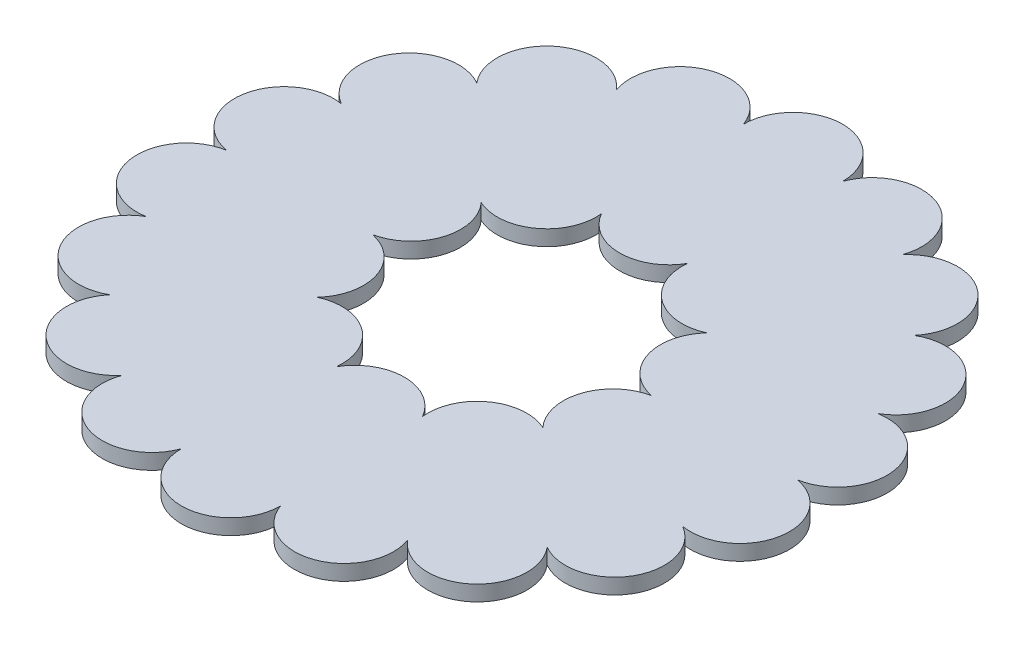
ISO-10303-21;
HEADER;
FILE_DESCRIPTION(('STEP AP214'),'2;1');
FILE_NAME('part.step','',(''),(''),'','','');
FILE_SCHEMA(('AUTOMOTIVE_DESIGN { 1 0 10303 214 1 1 1 1 }'));
ENDSEC;
DATA;
#1=APPLICATION_CONTEXT('core data for automotive mechanical design processes');
#2=APPLICATION_PROTOCOL_DEFINITION('international standard','automotive_design',2000,#1);
#3=PRODUCT_CONTEXT('',#1,'mechanical');
#4=PRODUCT('Part','Part','',(#3));
#5=PRODUCT_RELATED_PRODUCT_CATEGORY('part','',(#4));
#6=PRODUCT_DEFINITION_FORMATION('','',#4);
#7=PRODUCT_DEFINITION_CONTEXT('part definition',#1,'design');
#8=PRODUCT_DEFINITION('design','',#6,#7);
#9=PRODUCT_DEFINITION_SHAPE('','',#8);
#10=(LENGTH_UNIT() NAMED_UNIT(*) SI_UNIT(.MILLI.,.METRE.));
#11=(NAMED_UNIT(*) PLANE_ANGLE_UNIT() SI_UNIT($,.RADIAN.));
#12=(NAMED_UNIT(*) SI_UNIT($,.STERADIAN.) SOLID_ANGLE_UNIT());
#13=UNCERTAINTY_MEASURE_WITH_UNIT(LENGTH_MEASURE(1.E-05),#10,'distance_accuracy_value','');
#14=(GEOMETRIC_REPRESENTATION_CONTEXT(3) GLOBAL_UNCERTAINTY_ASSIGNED_CONTEXT((#13)) GLOBAL_UNIT_ASSIGNED_CONTEXT((#10,
#11,#12)) REPRESENTATION_CONTEXT('',''));
#15=CARTESIAN_POINT('',(0.,0.,0.));
#16=DIRECTION('',(0.,0.,1.));
#17=DIRECTION('',(1.,0.,0.));
#18=AXIS2_PLACEMENT_3D('',#15,#16,#17);
#19=CARTESIAN_POINT('',(0.,6.35,0.));
#20=DIRECTION('',(0.,1.,0.));
#21=DIRECTION('',(0.,0.,1.));
#22=AXIS2_PLACEMENT_3D('',#19,#20,#21);
#23=PLANE('',#22);
#24=CARTESIAN_POINT('',(0.,6.35,-64.4025612106915));
#25=DIRECTION('',(0.,1.,0.));
#26=DIRECTION('',(0.,0.,1.));
#27=AXIS2_PLACEMENT_3D('',#24,#25,#26);
#28=CIRCLE('',#27,20.32);
#29=CARTESIAN_POINT('',(-17.6595919495229,6.35,-54.3506354162805));
#30=VERTEX_POINT('',#29);
#31=CARTESIAN_POINT('',(17.6595919495239,6.35,-54.3506354162823));
#32=VERTEX_POINT('',#31);
#33=EDGE_CURVE('E320',#30,#32,#28,.T.);
#34=ORIENTED_EDGE('',*,*,#33,.T.);
#35=CARTESIAN_POINT('',(37.8548756895078,6.35,-52.1027665007222));
#36=DIRECTION('',(0.,1.,0.));
#37=DIRECTION('',(0.,0.,1.));
#38=AXIS2_PLACEMENT_3D('',#35,#36,#37);
#39=CIRCLE('',#38,20.32);
#40=CARTESIAN_POINT('',(46.2334119513036,6.35,-33.5905399974143));
#41=VERTEX_POINT('',#40);
#42=EDGE_CURVE('E503',#32,#41,#39,.T.);
#43=ORIENTED_EDGE('',*,*,#42,.T.);
#44=CARTESIAN_POINT('',(61.2504755055276,6.35,-19.9014858953791));
#45=DIRECTION('',(0.,1.,0.));
#46=DIRECTION('',(0.,0.,1.));
#47=AXIS2_PLACEMENT_3D('',#44,#45,#46);
#48=CIRCLE('',#47,20.3200000000012);
#49=CARTESIAN_POINT('',(57.1476400035595,6.35,-3.29597460435593E-12));
#50=VERTEX_POINT('',#49);
#51=EDGE_CURVE('E496',#41,#50,#48,.T.);
#52=ORIENTED_EDGE('',*,*,#51,.T.);
#53=CARTESIAN_POINT('',(61.2504755055293,6.35,19.9014858953739));
#54=DIRECTION('',(0.,1.,0.));
#55=DIRECTION('',(0.,0.,1.));
#56=AXIS2_PLACEMENT_3D('',#53,#54,#55);
#57=CIRCLE('',#56,20.3200000000029);
#58=CARTESIAN_POINT('',(46.2334119512969,6.35,33.5905399974024));
#59=VERTEX_POINT('',#58);
#60=EDGE_CURVE('E489',#50,#59,#57,.T.);
#61=ORIENTED_EDGE('',*,*,#60,.T.);
#62=CARTESIAN_POINT('',(37.8548756895127,6.35,52.1027665007206));
#63=DIRECTION('',(0.,1.,0.));
#64=DIRECTION('',(0.,0.,1.));
#65=AXIS2_PLACEMENT_3D('',#62,#63,#64);
#66=CIRCLE('',#65,20.3200000000046);
#67=CARTESIAN_POINT('',(17.6595919495215,6.35,54.350635416257));
#68=VERTEX_POINT('',#67);
#69=EDGE_CURVE('E482',#59,#68,#66,.T.);
#70=ORIENTED_EDGE('',*,*,#69,.T.);
#71=CARTESIAN_POINT('',(5.47551856582354E-12,6.35,64.4025612106915));
#72=DIRECTION('',(0.,1.,0.));
#73=DIRECTION('',(0.,0.,1.));
#74=AXIS2_PLACEMENT_3D('',#71,#72,#73);
#75=CIRCLE('',#74,20.3200000000057);
#76=CARTESIAN_POINT('',(-17.65959194951,6.35,54.350635416256));
#77=VERTEX_POINT('',#76);
#78=EDGE_CURVE('E475',#68,#77,#75,.T.);
#79=ORIENTED_EDGE('',*,*,#78,.T.);
#80=CARTESIAN_POINT('',(-37.8548756895028,6.35,52.1027665007239));
#81=DIRECTION('',(0.,1.,0.));
#82=DIRECTION('',(0.,0.,1.));
#83=AXIS2_PLACEMENT_3D('',#80,#81,#82);
#84=CIRCLE('',#83,20.3200000000057);
#85=CARTESIAN_POINT('',(-46.2334119512824,6.35,33.5905399974024));
#86=VERTEX_POINT('',#85);
#87=EDGE_CURVE('E469',#77,#86,#84,.T.);
#88=ORIENTED_EDGE('',*,*,#87,.T.);
#89=CARTESIAN_POINT('',(-61.2504755055221,6.35,19.9014858953791));
#90=DIRECTION('',(0.,1.,0.));
#91=DIRECTION('',(0.,0.,1.));
#92=AXIS2_PLACEMENT_3D('',#89,#90,#91);
#93=CIRCLE('',#92,20.3200000000048);
#94=CARTESIAN_POINT('',(-57.1476400035444,6.35,1.66186508998578E-12));
#95=VERTEX_POINT('',#94);
#96=EDGE_CURVE('E449',#86,#95,#93,.T.);
#97=ORIENTED_EDGE('',*,*,#96,.T.);
#98=CARTESIAN_POINT('',(-61.2504755055238,6.35,-19.9014858953739));
#99=DIRECTION('',(0.,1.,0.));
#100=DIRECTION('',(0.,0.,1.));
#101=AXIS2_PLACEMENT_3D('',#98,#99,#100);
#102=CIRCLE('',#101,20.3200000000033);
#103=CARTESIAN_POINT('',(-46.233411951302,6.35,-33.5905399974145));
#104=VERTEX_POINT('',#103);
#105=EDGE_CURVE('E441',#95,#104,#102,.T.);
#106=ORIENTED_EDGE('',*,*,#105,.T.);
#107=CARTESIAN_POINT('',(-37.8548756895071,6.35,-52.1027665007228));
#108=DIRECTION('',(0.,1.,0.));
#109=DIRECTION('',(0.,0.,1.));
#110=AXIS2_PLACEMENT_3D('',#107,#108,#109);
#111=CIRCLE('',#110,20.32);
#112=EDGE_CURVE('E446',#104,#30,#111,.T.);
#113=ORIENTED_EDGE('',*,*,#112,.T.);
#114=EDGE_LOOP('',(#34,#43,#52,#61,#70,#79,#88,#97,#106,#113));
#115=FACE_BOUND('',#114,.T.);
#116=CARTESIAN_POINT('',(-99.7683445894874,6.35,-57.6012806053401));
#117=DIRECTION('',(0.,1.,0.));
#118=DIRECTION('',(0.,0.,1.));
#119=AXIS2_PLACEMENT_3D('',#116,#117,#118);
#120=CIRCLE('',#119,20.3200000000061);
#121=CARTESIAN_POINT('',(-89.6410001009598,6.35,-75.217730123076));
#122=VERTEX_POINT('',#121);
#123=CARTESIAN_POINT('',(-109.960965152077,6.35,-40.0225182465356));
#124=VERTEX_POINT('',#123);
#125=EDGE_CURVE('E1003',#122,#124,#120,.T.);
#126=ORIENTED_EDGE('',*,*,#125,.T.);
#127=CARTESIAN_POINT('',(-113.452375447147,6.35,-20.0047148167931));
#128=DIRECTION('',(0.,1.,0.));
#129=DIRECTION('',(0.,0.,1.));
#130=AXIS2_PLACEMENT_3D('',#127,#128,#129);
#131=CIRCLE('',#130,20.3200000000082);
#132=CARTESIAN_POINT('',(-117.01801495485,6.35,5.59274848654923E-12));
#133=VERTEX_POINT('',#132);
#134=EDGE_CURVE('E992',#124,#133,#131,.T.);
#135=ORIENTED_EDGE('',*,*,#134,.T.);
#136=CARTESIAN_POINT('',(-113.452375447145,6.35,20.004714816806));
#137=DIRECTION('',(0.,1.,0.));
#138=DIRECTION('',(0.,0.,1.));
#139=AXIS2_PLACEMENT_3D('',#136,#137,#138);
#140=CIRCLE('',#139,20.3200000000103);
#141=CARTESIAN_POINT('',(-109.960965152095,6.35,40.0225182465542));
#142=VERTEX_POINT('',#141);
#143=EDGE_CURVE('E1014',#133,#142,#140,.T.);
#144=ORIENTED_EDGE('',*,*,#143,.T.);
#145=CARTESIAN_POINT('',(-99.7683445894808,6.35,57.6012806053515));
#146=DIRECTION('',(0.,1.,0.));
#147=DIRECTION('',(0.,0.,1.));
#148=AXIS2_PLACEMENT_3D('',#145,#146,#147);
#149=CIRCLE('',#148,20.3200000000121);
#150=CARTESIAN_POINT('',(-89.6410001009853,6.35,75.2177301231127));
#151=VERTEX_POINT('',#150);
#152=EDGE_CURVE('E1019',#142,#151,#149,.T.);
#153=ORIENTED_EDGE('',*,*,#152,.T.);
#154=CARTESIAN_POINT('',(-74.0507789503761,6.35,88.2502818485284));
#155=DIRECTION('',(0.,1.,0.));
#156=DIRECTION('',(0.,0.,1.));
#157=AXIS2_PLACEMENT_3D('',#154,#155,#156);
#158=CIRCLE('',#157,20.3200000000132);
#159=CARTESIAN_POINT('',(-58.5090074774276,6.35,101.340573651356));
#160=VERTEX_POINT('',#159);
#161=EDGE_CURVE('E1024',#151,#160,#158,.T.);
#162=ORIENTED_EDGE('',*,*,#161,.T.);
#163=CARTESIAN_POINT('',(-39.4015964967522,6.35,108.254996665326));
#164=DIRECTION('',(0.,1.,0.));
#165=DIRECTION('',(0.,0.,1.));
#166=AXIS2_PLACEMENT_3D('',#163,#164,#165);
#167=CIRCLE('',#166,20.3200000000136);
#168=CARTESIAN_POINT('',(-20.3199650511032,6.35,115.240248369665));
#169=VERTEX_POINT('',#168);
#170=EDGE_CURVE('E1029',#160,#169,#167,.T.);
#171=ORIENTED_EDGE('',*,*,#170,.T.);
#172=CARTESIAN_POINT('',(1.30687983919064E-11,6.35,115.202561210692));
#173=DIRECTION('',(0.,1.,0.));
#174=DIRECTION('',(0.,0.,1.));
#175=AXIS2_PLACEMENT_3D('',#172,#173,#174);
#176=CIRCLE('',#175,20.3200000000133);
#177=CARTESIAN_POINT('',(20.3199650511294,6.35,115.240248369659));
#178=VERTEX_POINT('',#177);
#179=EDGE_CURVE('E1034',#169,#178,#176,.T.);
#180=ORIENTED_EDGE('',*,*,#179,.T.);
#181=CARTESIAN_POINT('',(39.4015964967775,6.35,108.254996665322));
#182=DIRECTION('',(0.,1.,0.));
#183=DIRECTION('',(0.,0.,1.));
#184=AXIS2_PLACEMENT_3D('',#181,#182,#183);
#185=CIRCLE('',#184,20.3200000000121);
#186=CARTESIAN_POINT('',(58.5090074774467,6.35,101.340573651339));
#187=VERTEX_POINT('',#186);
#188=EDGE_CURVE('E1039',#178,#187,#185,.T.);
#189=ORIENTED_EDGE('',*,*,#188,.T.);
#190=CARTESIAN_POINT('',(74.0507789503992,6.35,88.25028184852));
#191=DIRECTION('',(0.,1.,0.));
#192=DIRECTION('',(0.,0.,1.));
#193=AXIS2_PLACEMENT_3D('',#190,#191,#192);
#194=CIRCLE('',#193,20.3200000000104);
#195=CARTESIAN_POINT('',(89.6410001009927,6.35,75.2177301230899));
#196=VERTEX_POINT('',#195);
#197=EDGE_CURVE('E1044',#187,#196,#194,.T.);
#198=ORIENTED_EDGE('',*,*,#197,.T.);
#199=CARTESIAN_POINT('',(99.7683445895005,6.35,57.6012806053401));
#200=DIRECTION('',(0.,1.,0.));
#201=DIRECTION('',(0.,0.,1.));
#202=AXIS2_PLACEMENT_3D('',#199,#200,#201);
#203=CIRCLE('',#202,20.3200000000083);
#204=CARTESIAN_POINT('',(109.960965152091,6.35,40.0225182465334));
#205=VERTEX_POINT('',#204);
#206=EDGE_CURVE('E1049',#196,#205,#203,.T.);
#207=ORIENTED_EDGE('',*,*,#206,.T.);
#208=CARTESIAN_POINT('',(113.45237544716,6.35,20.0047148167932));
#209=DIRECTION('',(0.,1.,0.));
#210=DIRECTION('',(0.,0.,1.));
#211=AXIS2_PLACEMENT_3D('',#208,#209,#210);
#212=CIRCLE('',#211,20.3200000000059);
#213=CARTESIAN_POINT('',(117.018014954837,6.35,-7.77850006628E-12));
#214=VERTEX_POINT('',#213);
#215=EDGE_CURVE('E1054',#205,#214,#212,.T.);
#216=ORIENTED_EDGE('',*,*,#215,.T.);
#217=CARTESIAN_POINT('',(113.452375447158,6.35,-20.004714816806));
#218=DIRECTION('',(0.,1.,0.));
#219=DIRECTION('',(0.,0.,1.));
#220=AXIS2_PLACEMENT_3D('',#217,#218,#219);
#221=CIRCLE('',#220,20.3200000000036);
#222=CARTESIAN_POINT('',(109.960965152062,6.35,-40.0225182465394));
#223=VERTEX_POINT('',#222);
#224=EDGE_CURVE('E1059',#214,#223,#221,.T.);
#225=ORIENTED_EDGE('',*,*,#224,.T.);
#226=CARTESIAN_POINT('',(99.7683445894939,6.35,-57.6012806053514));
#227=DIRECTION('',(0.,1.,0.));
#228=DIRECTION('',(0.,0.,1.));
#229=AXIS2_PLACEMENT_3D('',#226,#227,#228);
#230=CIRCLE('',#229,20.3200000000017);
#231=CARTESIAN_POINT('',(89.6410001009469,6.35,-75.2177301230712));
#232=VERTEX_POINT('',#231);
#233=EDGE_CURVE('E1064',#223,#232,#230,.T.);
#234=ORIENTED_EDGE('',*,*,#233,.T.);
#235=CARTESIAN_POINT('',(74.0507789503892,6.35,-88.2502818485284));
#236=DIRECTION('',(0.,1.,0.));
#237=DIRECTION('',(0.,0.,1.));
#238=AXIS2_PLACEMENT_3D('',#235,#236,#237);
#239=CIRCLE('',#238,20.3200000000004);
#240=CARTESIAN_POINT('',(58.5090074774037,6.35,-101.340573651292));
#241=VERTEX_POINT('',#240);
#242=EDGE_CURVE('E1069',#232,#241,#239,.T.);
#243=ORIENTED_EDGE('',*,*,#242,.T.);
#244=CARTESIAN_POINT('',(39.4015964967649,6.35,-108.254996665324));
#245=DIRECTION('',(0.,1.,0.));
#246=DIRECTION('',(0.,0.,1.));
#247=AXIS2_PLACEMENT_3D('',#244,#245,#246);
#248=CIRCLE('',#247,20.32);
#249=CARTESIAN_POINT('',(20.3199650511032,6.35,-115.240248369588));
#250=VERTEX_POINT('',#249);
#251=EDGE_CURVE('E1074',#241,#250,#248,.T.);
#252=ORIENTED_EDGE('',*,*,#251,.T.);
#253=CARTESIAN_POINT('',(0.,6.35,-115.202561210692));
#254=DIRECTION('',(0.,1.,0.));
#255=DIRECTION('',(0.,0.,1.));
#256=AXIS2_PLACEMENT_3D('',#253,#254,#255);
#257=CIRCLE('',#256,20.32);
#258=CARTESIAN_POINT('',(-20.3199650511032,6.35,-115.240248369593));
#259=VERTEX_POINT('',#258);
#260=EDGE_CURVE('E1079',#250,#259,#257,.T.);
#261=ORIENTED_EDGE('',*,*,#260,.T.);
#262=CARTESIAN_POINT('',(-39.4015964967635,6.35,-108.254996665324));
#263=DIRECTION('',(0.,1.,0.));
#264=DIRECTION('',(0.,0.,1.));
#265=AXIS2_PLACEMENT_3D('',#262,#263,#264);
#266=CIRCLE('',#265,20.32);
#267=CARTESIAN_POINT('',(-58.5090074774013,6.35,-101.34057365129));
#268=VERTEX_POINT('',#267);
#269=EDGE_CURVE('E330',#259,#268,#266,.T.);
#270=ORIENTED_EDGE('',*,*,#269,.T.);
#271=CARTESIAN_POINT('',(-74.0507789503861,6.35,-88.2502818485199));
#272=DIRECTION('',(0.,1.,0.));
#273=DIRECTION('',(0.,0.,1.));
#274=AXIS2_PLACEMENT_3D('',#271,#272,#273);
#275=CIRCLE('',#274,20.3200000000041);
#276=EDGE_CURVE('E508',#268,#122,#275,.T.);
#277=ORIENTED_EDGE('',*,*,#276,.T.);
#278=EDGE_LOOP('',(#126,#135,#144,#153,#162,#171,#180,#189,#198,#207,#216,#225,#234,#243,#252,
#261,#270,#277));
#279=FACE_BOUND('',#278,.T.);
#280=ADVANCED_FACE('F249',(#115,#279),#23,.T.);
#281=CARTESIAN_POINT('',(0.,0.,0.));
#282=DIRECTION('',(0.,1.,0.));
#283=DIRECTION('',(0.,0.,1.));
#284=AXIS2_PLACEMENT_3D('',#281,#282,#283);
#285=PLANE('',#284);
#286=CARTESIAN_POINT('',(37.8548756895078,0.,-52.1027665007222));
#287=DIRECTION('',(0.,1.,0.));
#288=DIRECTION('',(0.,0.,1.));
#289=AXIS2_PLACEMENT_3D('',#286,#287,#288);
#290=CIRCLE('',#289,20.32);
#291=CARTESIAN_POINT('',(17.6595919495239,0.,-54.3506354162823));
#292=VERTEX_POINT('',#291);
#293=CARTESIAN_POINT('',(46.2334119513036,0.,-33.5905399974143));
#294=VERTEX_POINT('',#293);
#295=EDGE_CURVE('E500',#292,#294,#290,.T.);
#296=ORIENTED_EDGE('',*,*,#295,.F.);
#297=CARTESIAN_POINT('',(0.,0.,-64.4025612106915));
#298=DIRECTION('',(0.,1.,0.));
#299=DIRECTION('',(0.,0.,1.));
#300=AXIS2_PLACEMENT_3D('',#297,#298,#299);
#301=CIRCLE('',#300,20.32);
#302=CARTESIAN_POINT('',(-17.6595919495229,0.,-54.3506354162805));
#303=VERTEX_POINT('',#302);
#304=EDGE_CURVE('E505',#303,#292,#301,.T.);
#305=ORIENTED_EDGE('',*,*,#304,.F.);
#306=CARTESIAN_POINT('',(-37.8548756895071,0.,-52.1027665007228));
#307=DIRECTION('',(0.,1.,0.));
#308=DIRECTION('',(0.,0.,1.));
#309=AXIS2_PLACEMENT_3D('',#306,#307,#308);
#310=CIRCLE('',#309,20.32);
#311=CARTESIAN_POINT('',(-46.233411951302,0.,-33.5905399974145));
#312=VERTEX_POINT('',#311);
#313=EDGE_CURVE('E453',#312,#303,#310,.T.);
#314=ORIENTED_EDGE('',*,*,#313,.F.);
#315=CARTESIAN_POINT('',(-61.2504755055238,0.,-19.9014858953739));
#316=DIRECTION('',(0.,1.,0.));
#317=DIRECTION('',(0.,0.,1.));
#318=AXIS2_PLACEMENT_3D('',#315,#316,#317);
#319=CIRCLE('',#318,20.3200000000033);
#320=CARTESIAN_POINT('',(-57.1476400035444,0.,1.66186508998578E-12));
#321=VERTEX_POINT('',#320);
#322=EDGE_CURVE('E443',#321,#312,#319,.T.);
#323=ORIENTED_EDGE('',*,*,#322,.F.);
#324=CARTESIAN_POINT('',(-61.2504755055221,0.,19.9014858953791));
#325=DIRECTION('',(0.,1.,0.));
#326=DIRECTION('',(0.,0.,1.));
#327=AXIS2_PLACEMENT_3D('',#324,#325,#326);
#328=CIRCLE('',#327,20.3200000000048);
#329=CARTESIAN_POINT('',(-46.2334119512824,0.,33.5905399974024));
#330=VERTEX_POINT('',#329);
#331=EDGE_CURVE('E461',#330,#321,#328,.T.);
#332=ORIENTED_EDGE('',*,*,#331,.F.);
#333=CARTESIAN_POINT('',(-37.8548756895028,0.,52.1027665007239));
#334=DIRECTION('',(0.,1.,0.));
#335=DIRECTION('',(0.,0.,1.));
#336=AXIS2_PLACEMENT_3D('',#333,#334,#335);
#337=CIRCLE('',#336,20.3200000000057);
#338=CARTESIAN_POINT('',(-17.65959194951,0.,54.350635416256));
#339=VERTEX_POINT('',#338);
#340=EDGE_CURVE('E466',#339,#330,#337,.T.);
#341=ORIENTED_EDGE('',*,*,#340,.F.);
#342=CARTESIAN_POINT('',(5.47551856582354E-12,0.,64.4025612106915));
#343=DIRECTION('',(0.,1.,0.));
#344=DIRECTION('',(0.,0.,1.));
#345=AXIS2_PLACEMENT_3D('',#342,#343,#344);
#346=CIRCLE('',#345,20.3200000000057);
#347=CARTESIAN_POINT('',(17.6595919495215,0.,54.350635416257));
#348=VERTEX_POINT('',#347);
#349=EDGE_CURVE('E472',#348,#339,#346,.T.);
#350=ORIENTED_EDGE('',*,*,#349,.F.);
#351=CARTESIAN_POINT('',(37.8548756895127,0.,52.1027665007206));
#352=DIRECTION('',(0.,1.,0.));
#353=DIRECTION('',(0.,0.,1.));
#354=AXIS2_PLACEMENT_3D('',#351,#352,#353);
#355=CIRCLE('',#354,20.3200000000046);
#356=CARTESIAN_POINT('',(46.2334119512969,0.,33.5905399974024));
#357=VERTEX_POINT('',#356);
#358=EDGE_CURVE('E479',#357,#348,#355,.T.);
#359=ORIENTED_EDGE('',*,*,#358,.F.);
#360=CARTESIAN_POINT('',(61.2504755055293,0.,19.9014858953739));
#361=DIRECTION('',(0.,1.,0.));
#362=DIRECTION('',(0.,0.,1.));
#363=AXIS2_PLACEMENT_3D('',#360,#361,#362);
#364=CIRCLE('',#363,20.3200000000029);
#365=CARTESIAN_POINT('',(57.1476400035595,0.,-3.29597460435593E-12));
#366=VERTEX_POINT('',#365);
#367=EDGE_CURVE('E486',#366,#357,#364,.T.);
#368=ORIENTED_EDGE('',*,*,#367,.F.);
#369=CARTESIAN_POINT('',(61.2504755055276,0.,-19.9014858953791));
#370=DIRECTION('',(0.,1.,0.));
#371=DIRECTION('',(0.,0.,1.));
#372=AXIS2_PLACEMENT_3D('',#369,#370,#371);
#373=CIRCLE('',#372,20.3200000000012);
#374=EDGE_CURVE('E493',#294,#366,#373,.T.);
#375=ORIENTED_EDGE('',*,*,#374,.F.);
#376=EDGE_LOOP('',(#296,#305,#314,#323,#332,#341,#350,#359,#368,#375));
#377=FACE_BOUND('',#376,.T.);
#378=CARTESIAN_POINT('',(-113.452375447147,0.,-20.0047148167931));
#379=DIRECTION('',(0.,1.,0.));
#380=DIRECTION('',(0.,0.,1.));
#381=AXIS2_PLACEMENT_3D('',#378,#379,#380);
#382=CIRCLE('',#381,20.3200000000082);
#383=CARTESIAN_POINT('',(-109.960965152077,0.,-40.0225182465356));
#384=VERTEX_POINT('',#383);
#385=CARTESIAN_POINT('',(-117.01801495485,0.,5.59274848654923E-12));
#386=VERTEX_POINT('',#385);
#387=EDGE_CURVE('E1000',#384,#386,#382,.T.);
#388=ORIENTED_EDGE('',*,*,#387,.F.);
#389=CARTESIAN_POINT('',(-99.7683445894874,0.,-57.6012806053401));
#390=DIRECTION('',(0.,1.,0.));
#391=DIRECTION('',(0.,0.,1.));
#392=AXIS2_PLACEMENT_3D('',#389,#390,#391);
#393=CIRCLE('',#392,20.3200000000061);
#394=CARTESIAN_POINT('',(-89.6410001009598,0.,-75.217730123076));
#395=VERTEX_POINT('',#394);
#396=EDGE_CURVE('E1005',#395,#384,#393,.T.);
#397=ORIENTED_EDGE('',*,*,#396,.F.);
#398=CARTESIAN_POINT('',(-74.0507789503861,0.,-88.2502818485199));
#399=DIRECTION('',(0.,1.,0.));
#400=DIRECTION('',(0.,0.,1.));
#401=AXIS2_PLACEMENT_3D('',#398,#399,#400);
#402=CIRCLE('',#401,20.3200000000041);
#403=CARTESIAN_POINT('',(-58.5090074774013,0.,-101.34057365129));
#404=VERTEX_POINT('',#403);
#405=EDGE_CURVE('E1085',#404,#395,#402,.T.);
#406=ORIENTED_EDGE('',*,*,#405,.F.);
#407=CARTESIAN_POINT('',(-39.4015964967635,0.,-108.254996665324));
#408=DIRECTION('',(0.,1.,0.));
#409=DIRECTION('',(0.,0.,1.));
#410=AXIS2_PLACEMENT_3D('',#407,#408,#409);
#411=CIRCLE('',#410,20.32);
#412=CARTESIAN_POINT('',(-20.3199650511032,0.,-115.240248369593));
#413=VERTEX_POINT('',#412);
#414=EDGE_CURVE('E1082',#413,#404,#411,.T.);
#415=ORIENTED_EDGE('',*,*,#414,.F.);
#416=CARTESIAN_POINT('',(0.,0.,-115.202561210692));
#417=DIRECTION('',(0.,1.,0.));
#418=DIRECTION('',(0.,0.,1.));
#419=AXIS2_PLACEMENT_3D('',#416,#417,#418);
#420=CIRCLE('',#419,20.32);
#421=CARTESIAN_POINT('',(20.3199650511032,0.,-115.240248369588));
#422=VERTEX_POINT('',#421);
#423=EDGE_CURVE('E1077',#422,#413,#420,.T.);
#424=ORIENTED_EDGE('',*,*,#423,.F.);
#425=CARTESIAN_POINT('',(39.4015964967649,0.,-108.254996665324));
#426=DIRECTION('',(0.,1.,0.));
#427=DIRECTION('',(0.,0.,1.));
#428=AXIS2_PLACEMENT_3D('',#425,#426,#427);
#429=CIRCLE('',#428,20.32);
#430=CARTESIAN_POINT('',(58.5090074774037,0.,-101.340573651292));
#431=VERTEX_POINT('',#430);
#432=EDGE_CURVE('E1072',#431,#422,#429,.T.);
#433=ORIENTED_EDGE('',*,*,#432,.F.);
#434=CARTESIAN_POINT('',(74.0507789503892,0.,-88.2502818485284));
#435=DIRECTION('',(0.,1.,0.));
#436=DIRECTION('',(0.,0.,1.));
#437=AXIS2_PLACEMENT_3D('',#434,#435,#436);
#438=CIRCLE('',#437,20.3200000000004);
#439=CARTESIAN_POINT('',(89.6410001009469,0.,-75.2177301230712));
#440=VERTEX_POINT('',#439);
#441=EDGE_CURVE('E1067',#440,#431,#438,.T.);
#442=ORIENTED_EDGE('',*,*,#441,.F.);
#443=CARTESIAN_POINT('',(99.7683445894939,0.,-57.6012806053514));
#444=DIRECTION('',(0.,1.,0.));
#445=DIRECTION('',(0.,0.,1.));
#446=AXIS2_PLACEMENT_3D('',#443,#444,#445);
#447=CIRCLE('',#446,20.3200000000017);
#448=CARTESIAN_POINT('',(109.960965152062,0.,-40.0225182465394));
#449=VERTEX_POINT('',#448);
#450=EDGE_CURVE('E1062',#449,#440,#447,.T.);
#451=ORIENTED_EDGE('',*,*,#450,.F.);
#452=CARTESIAN_POINT('',(113.452375447158,0.,-20.004714816806));
#453=DIRECTION('',(0.,1.,0.));
#454=DIRECTION('',(0.,0.,1.));
#455=AXIS2_PLACEMENT_3D('',#452,#453,#454);
#456=CIRCLE('',#455,20.3200000000036);
#457=CARTESIAN_POINT('',(117.018014954837,0.,-7.77850006628E-12));
#458=VERTEX_POINT('',#457);
#459=EDGE_CURVE('E1057',#458,#449,#456,.T.);
#460=ORIENTED_EDGE('',*,*,#459,.F.);
#461=CARTESIAN_POINT('',(113.45237544716,0.,20.0047148167932));
#462=DIRECTION('',(0.,1.,0.));
#463=DIRECTION('',(0.,0.,1.));
#464=AXIS2_PLACEMENT_3D('',#461,#462,#463);
#465=CIRCLE('',#464,20.3200000000059);
#466=CARTESIAN_POINT('',(109.960965152091,0.,40.0225182465334));
#467=VERTEX_POINT('',#466);
#468=EDGE_CURVE('E1052',#467,#458,#465,.T.);
#469=ORIENTED_EDGE('',*,*,#468,.F.);
#470=CARTESIAN_POINT('',(99.7683445895005,0.,57.6012806053401));
#471=DIRECTION('',(0.,1.,0.));
#472=DIRECTION('',(0.,0.,1.));
#473=AXIS2_PLACEMENT_3D('',#470,#471,#472);
#474=CIRCLE('',#473,20.3200000000083);
#475=CARTESIAN_POINT('',(89.6410001009927,0.,75.2177301230899));
#476=VERTEX_POINT('',#475);
#477=EDGE_CURVE('E1047',#476,#467,#474,.T.);
#478=ORIENTED_EDGE('',*,*,#477,.F.);
#479=CARTESIAN_POINT('',(74.0507789503992,0.,88.25028184852));
#480=DIRECTION('',(0.,1.,0.));
#481=DIRECTION('',(0.,0.,1.));
#482=AXIS2_PLACEMENT_3D('',#479,#480,#481);
#483=CIRCLE('',#482,20.3200000000104);
#484=CARTESIAN_POINT('',(58.5090074774467,0.,101.340573651339));
#485=VERTEX_POINT('',#484);
#486=EDGE_CURVE('E1042',#485,#476,#483,.T.);
#487=ORIENTED_EDGE('',*,*,#486,.F.);
#488=CARTESIAN_POINT('',(39.4015964967775,0.,108.254996665322));
#489=DIRECTION('',(0.,1.,0.));
#490=DIRECTION('',(0.,0.,1.));
#491=AXIS2_PLACEMENT_3D('',#488,#489,#490);
#492=CIRCLE('',#491,20.3200000000121);
#493=CARTESIAN_POINT('',(20.3199650511294,0.,115.240248369659));
#494=VERTEX_POINT('',#493);
#495=EDGE_CURVE('E1037',#494,#485,#492,.T.);
#496=ORIENTED_EDGE('',*,*,#495,.F.);
#497=CARTESIAN_POINT('',(1.30687983919064E-11,0.,115.202561210692));
#498=DIRECTION('',(0.,1.,0.));
#499=DIRECTION('',(0.,0.,1.));
#500=AXIS2_PLACEMENT_3D('',#497,#498,#499);
#501=CIRCLE('',#500,20.3200000000133);
#502=CARTESIAN_POINT('',(-20.3199650511032,0.,115.240248369665));
#503=VERTEX_POINT('',#502);
#504=EDGE_CURVE('E1032',#503,#494,#501,.T.);
#505=ORIENTED_EDGE('',*,*,#504,.F.);
#506=CARTESIAN_POINT('',(-39.4015964967522,0.,108.254996665326));
#507=DIRECTION('',(0.,1.,0.));
#508=DIRECTION('',(0.,0.,1.));
#509=AXIS2_PLACEMENT_3D('',#506,#507,#508);
#510=CIRCLE('',#509,20.3200000000136);
#511=CARTESIAN_POINT('',(-58.5090074774276,0.,101.340573651356));
#512=VERTEX_POINT('',#511);
#513=EDGE_CURVE('E1027',#512,#503,#510,.T.);
#514=ORIENTED_EDGE('',*,*,#513,.F.);
#515=CARTESIAN_POINT('',(-74.0507789503761,0.,88.2502818485284));
#516=DIRECTION('',(0.,1.,0.));
#517=DIRECTION('',(0.,0.,1.));
#518=AXIS2_PLACEMENT_3D('',#515,#516,#517);
#519=CIRCLE('',#518,20.3200000000132);
#520=CARTESIAN_POINT('',(-89.6410001009853,0.,75.2177301231127));
#521=VERTEX_POINT('',#520);
#522=EDGE_CURVE('E1022',#521,#512,#519,.T.);
#523=ORIENTED_EDGE('',*,*,#522,.F.);
#524=CARTESIAN_POINT('',(-99.7683445894808,0.,57.6012806053515));
#525=DIRECTION('',(0.,1.,0.));
#526=DIRECTION('',(0.,0.,1.));
#527=AXIS2_PLACEMENT_3D('',#524,#525,#526);
#528=CIRCLE('',#527,20.3200000000121);
#529=CARTESIAN_POINT('',(-109.960965152095,0.,40.0225182465542));
#530=VERTEX_POINT('',#529);
#531=EDGE_CURVE('E1017',#530,#521,#528,.T.);
#532=ORIENTED_EDGE('',*,*,#531,.F.);
#533=CARTESIAN_POINT('',(-113.452375447145,0.,20.004714816806));
#534=DIRECTION('',(0.,1.,0.));
#535=DIRECTION('',(0.,0.,1.));
#536=AXIS2_PLACEMENT_3D('',#533,#534,#535);
#537=CIRCLE('',#536,20.3200000000103);
#538=EDGE_CURVE('E1012',#386,#530,#537,.T.);
#539=ORIENTED_EDGE('',*,*,#538,.F.);
#540=EDGE_LOOP('',(#388,#397,#406,#415,#424,#433,#442,#451,#460,#469,#478,#487,#496,#505,#514,
#523,#532,#539));
#541=FACE_BOUND('',#540,.T.);
#542=ADVANCED_FACE('F251',(#377,#541),#285,.F.);
#543=CARTESIAN_POINT('',(-37.8548756895071,0.,-52.1027665007228));
#544=DIRECTION('',(0.,1.,0.));
#545=DIRECTION('',(0.,0.,1.));
#546=AXIS2_PLACEMENT_3D('',#543,#544,#545);
#547=CYLINDRICAL_SURFACE('',#546,20.32);
#548=DIRECTION('',(0.,1.,0.));
#549=VECTOR('',#548,1.);
#550=CARTESIAN_POINT('',(-46.233411951302,3.175,-33.5905399974145));
#551=LINE('',#550,#549);
#552=EDGE_CURVE('E12',#312,#104,#551,.T.);
#553=ORIENTED_EDGE('',*,*,#552,.F.);
#554=ORIENTED_EDGE('',*,*,#313,.T.);
#555=DIRECTION('',(0.,1.,0.));
#556=VECTOR('',#555,1.);
#557=CARTESIAN_POINT('',(-17.6595919495229,3.175,-54.3506354162805));
#558=LINE('',#557,#556);
#559=EDGE_CURVE('E258',#30,#303,#558,.F.);
#560=ORIENTED_EDGE('',*,*,#559,.F.);
#561=ORIENTED_EDGE('',*,*,#112,.F.);
#562=EDGE_LOOP('',(#553,#554,#560,#561));
#563=FACE_BOUND('',#562,.T.);
#564=ADVANCED_FACE('F452',(#563),#547,.T.);
#565=CARTESIAN_POINT('',(37.8548756895127,0.,52.1027665007206));
#566=DIRECTION('',(0.,1.,0.));
#567=DIRECTION('',(0.,0.,1.));
#568=AXIS2_PLACEMENT_3D('',#565,#566,#567);
#569=CYLINDRICAL_SURFACE('',#568,20.3200000000046);
#570=ORIENTED_EDGE('',*,*,#358,.T.);
#571=DIRECTION('',(0.,1.,0.));
#572=VECTOR('',#571,1.);
#573=CARTESIAN_POINT('',(17.6595919495215,3.175,54.350635416257));
#574=LINE('',#573,#572);
#575=EDGE_CURVE('E471',#348,#68,#574,.T.);
#576=ORIENTED_EDGE('',*,*,#575,.T.);
#577=ORIENTED_EDGE('',*,*,#69,.F.);
#578=DIRECTION('',(0.,1.,0.));
#579=VECTOR('',#578,1.);
#580=CARTESIAN_POINT('',(46.2334119512969,3.175,33.5905399974025));
#581=LINE('',#580,#579);
#582=EDGE_CURVE('E478',#357,#59,#581,.T.);
#583=ORIENTED_EDGE('',*,*,#582,.F.);
#584=EDGE_LOOP('',(#570,#576,#577,#583));
#585=FACE_BOUND('',#584,.T.);
#586=ADVANCED_FACE('F537',(#585),#569,.T.);
#587=CARTESIAN_POINT('',(61.2504755055293,0.,19.9014858953739));
#588=DIRECTION('',(0.,1.,0.));
#589=DIRECTION('',(0.,0.,1.));
#590=AXIS2_PLACEMENT_3D('',#587,#588,#589);
#591=CYLINDRICAL_SURFACE('',#590,20.3200000000029);
#592=ORIENTED_EDGE('',*,*,#367,.T.);
#593=ORIENTED_EDGE('',*,*,#582,.T.);
#594=ORIENTED_EDGE('',*,*,#60,.F.);
#595=DIRECTION('',(0.,1.,0.));
#596=VECTOR('',#595,1.);
#597=CARTESIAN_POINT('',(57.1476400035595,3.175,-3.30291349825984E-12));
#598=LINE('',#597,#596);
#599=EDGE_CURVE('E485',#366,#50,#598,.T.);
#600=ORIENTED_EDGE('',*,*,#599,.F.);
#601=EDGE_LOOP('',(#592,#593,#594,#600));
#602=FACE_BOUND('',#601,.T.);
#603=ADVANCED_FACE('F532',(#602),#591,.T.);
#604=CARTESIAN_POINT('',(61.2504755055276,0.,-19.9014858953791));
#605=DIRECTION('',(0.,1.,0.));
#606=DIRECTION('',(0.,0.,1.));
#607=AXIS2_PLACEMENT_3D('',#604,#605,#606);
#608=CYLINDRICAL_SURFACE('',#607,20.3200000000012);
#609=ORIENTED_EDGE('',*,*,#374,.T.);
#610=ORIENTED_EDGE('',*,*,#599,.T.);
#611=ORIENTED_EDGE('',*,*,#51,.F.);
#612=DIRECTION('',(0.,1.,0.));
#613=VECTOR('',#612,1.);
#614=CARTESIAN_POINT('',(46.2334119513036,3.175,-33.5905399974143));
#615=LINE('',#614,#613);
#616=EDGE_CURVE('E492',#294,#41,#615,.T.);
#617=ORIENTED_EDGE('',*,*,#616,.F.);
#618=EDGE_LOOP('',(#609,#610,#611,#617));
#619=FACE_BOUND('',#618,.T.);
#620=ADVANCED_FACE('F530',(#619),#608,.T.);
#621=CARTESIAN_POINT('',(37.8548756895078,0.,-52.1027665007222));
#622=DIRECTION('',(0.,1.,0.));
#623=DIRECTION('',(0.,0.,1.));
#624=AXIS2_PLACEMENT_3D('',#621,#622,#623);
#625=CYLINDRICAL_SURFACE('',#624,20.32);
#626=ORIENTED_EDGE('',*,*,#295,.T.);
#627=ORIENTED_EDGE('',*,*,#616,.T.);
#628=ORIENTED_EDGE('',*,*,#42,.F.);
#629=DIRECTION('',(0.,1.,0.));
#630=VECTOR('',#629,1.);
#631=CARTESIAN_POINT('',(17.6595919495239,3.175,-54.3506354162823));
#632=LINE('',#631,#630);
#633=EDGE_CURVE('E499',#292,#32,#632,.T.);
#634=ORIENTED_EDGE('',*,*,#633,.F.);
#635=EDGE_LOOP('',(#626,#627,#628,#634));
#636=FACE_BOUND('',#635,.T.);
#637=ADVANCED_FACE('F525',(#636),#625,.T.);
#638=CARTESIAN_POINT('',(0.,0.,-64.4025612106915));
#639=DIRECTION('',(0.,1.,0.));
#640=DIRECTION('',(0.,0.,1.));
#641=AXIS2_PLACEMENT_3D('',#638,#639,#640);
#642=CYLINDRICAL_SURFACE('',#641,20.32);
#643=ORIENTED_EDGE('',*,*,#33,.F.);
#644=ORIENTED_EDGE('',*,*,#559,.T.);
#645=ORIENTED_EDGE('',*,*,#304,.T.);
#646=ORIENTED_EDGE('',*,*,#633,.T.);
#647=EDGE_LOOP('',(#643,#644,#645,#646));
#648=FACE_BOUND('',#647,.T.);
#649=ADVANCED_FACE('F517',(#648),#642,.T.);
#650=CARTESIAN_POINT('',(5.47551856582354E-12,0.,64.4025612106915));
#651=DIRECTION('',(0.,1.,0.));
#652=DIRECTION('',(0.,0.,1.));
#653=AXIS2_PLACEMENT_3D('',#650,#651,#652);
#654=CYLINDRICAL_SURFACE('',#653,20.3200000000057);
#655=ORIENTED_EDGE('',*,*,#349,.T.);
#656=DIRECTION('',(0.,1.,0.));
#657=VECTOR('',#656,1.);
#658=CARTESIAN_POINT('',(-17.65959194951,3.175,54.350635416256));
#659=LINE('',#658,#657);
#660=EDGE_CURVE('E465',#339,#77,#659,.T.);
#661=ORIENTED_EDGE('',*,*,#660,.T.);
#662=ORIENTED_EDGE('',*,*,#78,.F.);
#663=ORIENTED_EDGE('',*,*,#575,.F.);
#664=EDGE_LOOP('',(#655,#661,#662,#663));
#665=FACE_BOUND('',#664,.T.);
#666=ADVANCED_FACE('F540',(#665),#654,.T.);
#667=CARTESIAN_POINT('',(-37.8548756895028,0.,52.1027665007239));
#668=DIRECTION('',(0.,1.,0.));
#669=DIRECTION('',(0.,0.,1.));
#670=AXIS2_PLACEMENT_3D('',#667,#668,#669);
#671=CYLINDRICAL_SURFACE('',#670,20.3200000000057);
#672=ORIENTED_EDGE('',*,*,#340,.T.);
#673=DIRECTION('',(0.,1.,0.));
#674=VECTOR('',#673,1.);
#675=CARTESIAN_POINT('',(-46.2334119512824,3.175,33.5905399974024));
#676=LINE('',#675,#674);
#677=EDGE_CURVE('E450',#330,#86,#676,.T.);
#678=ORIENTED_EDGE('',*,*,#677,.T.);
#679=ORIENTED_EDGE('',*,*,#87,.F.);
#680=ORIENTED_EDGE('',*,*,#660,.F.);
#681=EDGE_LOOP('',(#672,#678,#679,#680));
#682=FACE_BOUND('',#681,.T.);
#683=ADVANCED_FACE('F544',(#682),#671,.T.);
#684=CARTESIAN_POINT('',(-61.2504755055221,0.,19.9014858953791));
#685=DIRECTION('',(0.,1.,0.));
#686=DIRECTION('',(0.,0.,1.));
#687=AXIS2_PLACEMENT_3D('',#684,#685,#686);
#688=CYLINDRICAL_SURFACE('',#687,20.3200000000048);
#689=ORIENTED_EDGE('',*,*,#331,.T.);
#690=DIRECTION('',(0.,1.,0.));
#691=VECTOR('',#690,1.);
#692=CARTESIAN_POINT('',(-57.1476400035444,3.175,1.66186508998578E-12));
#693=LINE('',#692,#691);
#694=EDGE_CURVE('E454',#321,#95,#693,.T.);
#695=ORIENTED_EDGE('',*,*,#694,.T.);
#696=ORIENTED_EDGE('',*,*,#96,.F.);
#697=ORIENTED_EDGE('',*,*,#677,.F.);
#698=EDGE_LOOP('',(#689,#695,#696,#697));
#699=FACE_BOUND('',#698,.T.);
#700=ADVANCED_FACE('F547',(#699),#688,.T.);
#701=CARTESIAN_POINT('',(-61.2504755055238,0.,-19.9014858953739));
#702=DIRECTION('',(0.,1.,0.));
#703=DIRECTION('',(0.,0.,1.));
#704=AXIS2_PLACEMENT_3D('',#701,#702,#703);
#705=CYLINDRICAL_SURFACE('',#704,20.3200000000033);
#706=ORIENTED_EDGE('',*,*,#322,.T.);
#707=ORIENTED_EDGE('',*,*,#552,.T.);
#708=ORIENTED_EDGE('',*,*,#105,.F.);
#709=ORIENTED_EDGE('',*,*,#694,.F.);
#710=EDGE_LOOP('',(#706,#707,#708,#709));
#711=FACE_BOUND('',#710,.T.);
#712=ADVANCED_FACE('F440',(#711),#705,.T.);
#713=CARTESIAN_POINT('',(-99.7683445894874,0.,-57.6012806053401));
#714=DIRECTION('',(0.,1.,0.));
#715=DIRECTION('',(0.,0.,1.));
#716=AXIS2_PLACEMENT_3D('',#713,#714,#715);
#717=CYLINDRICAL_SURFACE('',#716,20.3200000000061);
#718=DIRECTION('',(0.,1.,0.));
#719=VECTOR('',#718,1.);
#720=CARTESIAN_POINT('',(-109.960965152077,3.175,-40.0225182465357));
#721=LINE('',#720,#719);
#722=EDGE_CURVE('E994',#124,#384,#721,.F.);
#723=ORIENTED_EDGE('',*,*,#722,.F.);
#724=ORIENTED_EDGE('',*,*,#125,.F.);
#725=DIRECTION('',(0.,1.,0.));
#726=VECTOR('',#725,1.);
#727=CARTESIAN_POINT('',(-89.6410001009598,3.175,-75.217730123076));
#728=LINE('',#727,#726);
#729=EDGE_CURVE('E1009',#395,#122,#728,.T.);
#730=ORIENTED_EDGE('',*,*,#729,.F.);
#731=ORIENTED_EDGE('',*,*,#396,.T.);
#732=EDGE_LOOP('',(#723,#724,#730,#731));
#733=FACE_BOUND('',#732,.T.);
#734=ADVANCED_FACE('F554',(#733),#717,.T.);
#735=CARTESIAN_POINT('',(99.7683445895005,0.,57.6012806053401));
#736=DIRECTION('',(0.,1.,0.));
#737=DIRECTION('',(0.,0.,1.));
#738=AXIS2_PLACEMENT_3D('',#735,#736,#737);
#739=CYLINDRICAL_SURFACE('',#738,20.3200000000083);
#740=ORIENTED_EDGE('',*,*,#206,.F.);
#741=DIRECTION('',(0.,1.,0.));
#742=VECTOR('',#741,1.);
#743=CARTESIAN_POINT('',(89.6410001009927,3.175,75.2177301230899));
#744=LINE('',#743,#742);
#745=EDGE_CURVE('E1041',#196,#476,#744,.F.);
#746=ORIENTED_EDGE('',*,*,#745,.T.);
#747=ORIENTED_EDGE('',*,*,#477,.T.);
#748=DIRECTION('',(0.,1.,0.));
#749=VECTOR('',#748,1.);
#750=CARTESIAN_POINT('',(109.960965152091,3.175,40.0225182465334));
#751=LINE('',#750,#749);
#752=EDGE_CURVE('E1046',#205,#467,#751,.F.);
#753=ORIENTED_EDGE('',*,*,#752,.F.);
#754=EDGE_LOOP('',(#740,#746,#747,#753));
#755=FACE_BOUND('',#754,.T.);
#756=ADVANCED_FACE('F600',(#755),#739,.T.);
#757=CARTESIAN_POINT('',(113.45237544716,0.,20.0047148167932));
#758=DIRECTION('',(0.,1.,0.));
#759=DIRECTION('',(0.,0.,1.));
#760=AXIS2_PLACEMENT_3D('',#757,#758,#759);
#761=CYLINDRICAL_SURFACE('',#760,20.3200000000059);
#762=ORIENTED_EDGE('',*,*,#215,.F.);
#763=ORIENTED_EDGE('',*,*,#752,.T.);
#764=ORIENTED_EDGE('',*,*,#468,.T.);
#765=DIRECTION('',(0.,1.,0.));
#766=VECTOR('',#765,1.);
#767=CARTESIAN_POINT('',(117.018014954837,3.175,-7.77503061932805E-12));
#768=LINE('',#767,#766);
#769=EDGE_CURVE('E1051',#214,#458,#768,.F.);
#770=ORIENTED_EDGE('',*,*,#769,.F.);
#771=EDGE_LOOP('',(#762,#763,#764,#770));
#772=FACE_BOUND('',#771,.T.);
#773=ADVANCED_FACE('F610',(#772),#761,.T.);
#774=CARTESIAN_POINT('',(113.452375447158,0.,-20.004714816806));
#775=DIRECTION('',(0.,1.,0.));
#776=DIRECTION('',(0.,0.,1.));
#777=AXIS2_PLACEMENT_3D('',#774,#775,#776);
#778=CYLINDRICAL_SURFACE('',#777,20.3200000000036);
#779=ORIENTED_EDGE('',*,*,#224,.F.);
#780=ORIENTED_EDGE('',*,*,#769,.T.);
#781=ORIENTED_EDGE('',*,*,#459,.T.);
#782=DIRECTION('',(0.,1.,0.));
#783=VECTOR('',#782,1.);
#784=CARTESIAN_POINT('',(109.960965152062,3.175,-40.0225182465394));
#785=LINE('',#784,#783);
#786=EDGE_CURVE('E1056',#223,#449,#785,.F.);
#787=ORIENTED_EDGE('',*,*,#786,.F.);
#788=EDGE_LOOP('',(#779,#780,#781,#787));
#789=FACE_BOUND('',#788,.T.);
#790=ADVANCED_FACE('F620',(#789),#778,.T.);
#791=CARTESIAN_POINT('',(99.7683445894939,0.,-57.6012806053514));
#792=DIRECTION('',(0.,1.,0.));
#793=DIRECTION('',(0.,0.,1.));
#794=AXIS2_PLACEMENT_3D('',#791,#792,#793);
#795=CYLINDRICAL_SURFACE('',#794,20.3200000000017);
#796=ORIENTED_EDGE('',*,*,#233,.F.);
#797=ORIENTED_EDGE('',*,*,#786,.T.);
#798=ORIENTED_EDGE('',*,*,#450,.T.);
#799=DIRECTION('',(0.,1.,0.));
#800=VECTOR('',#799,1.);
#801=CARTESIAN_POINT('',(89.6410001009469,3.175,-75.2177301230712));
#802=LINE('',#801,#800);
#803=EDGE_CURVE('E1061',#232,#440,#802,.F.);
#804=ORIENTED_EDGE('',*,*,#803,.F.);
#805=EDGE_LOOP('',(#796,#797,#798,#804));
#806=FACE_BOUND('',#805,.T.);
#807=ADVANCED_FACE('F630',(#806),#795,.T.);
#808=CARTESIAN_POINT('',(74.0507789503892,0.,-88.2502818485284));
#809=DIRECTION('',(0.,1.,0.));
#810=DIRECTION('',(0.,0.,1.));
#811=AXIS2_PLACEMENT_3D('',#808,#809,#810);
#812=CYLINDRICAL_SURFACE('',#811,20.3200000000004);
#813=ORIENTED_EDGE('',*,*,#242,.F.);
#814=ORIENTED_EDGE('',*,*,#803,.T.);
#815=ORIENTED_EDGE('',*,*,#441,.T.);
#816=DIRECTION('',(0.,1.,0.));
#817=VECTOR('',#816,1.);
#818=CARTESIAN_POINT('',(58.5090074774037,3.175,-101.340573651292));
#819=LINE('',#818,#817);
#820=EDGE_CURVE('E1066',#241,#431,#819,.F.);
#821=ORIENTED_EDGE('',*,*,#820,.F.);
#822=EDGE_LOOP('',(#813,#814,#815,#821));
#823=FACE_BOUND('',#822,.T.);
#824=ADVANCED_FACE('F640',(#823),#812,.T.);
#825=CARTESIAN_POINT('',(39.4015964967649,0.,-108.254996665324));
#826=DIRECTION('',(0.,1.,0.));
#827=DIRECTION('',(0.,0.,1.));
#828=AXIS2_PLACEMENT_3D('',#825,#826,#827);
#829=CYLINDRICAL_SURFACE('',#828,20.32);
#830=ORIENTED_EDGE('',*,*,#251,.F.);
#831=ORIENTED_EDGE('',*,*,#820,.T.);
#832=ORIENTED_EDGE('',*,*,#432,.T.);
#833=DIRECTION('',(0.,1.,0.));
#834=VECTOR('',#833,1.);
#835=CARTESIAN_POINT('',(20.3199650511032,3.175,-115.240248369588));
#836=LINE('',#835,#834);
#837=EDGE_CURVE('E1071',#250,#422,#836,.F.);
#838=ORIENTED_EDGE('',*,*,#837,.F.);
#839=EDGE_LOOP('',(#830,#831,#832,#838));
#840=FACE_BOUND('',#839,.T.);
#841=ADVANCED_FACE('F650',(#840),#829,.T.);
#842=CARTESIAN_POINT('',(0.,0.,-115.202561210692));
#843=DIRECTION('',(0.,1.,0.));
#844=DIRECTION('',(0.,0.,1.));
#845=AXIS2_PLACEMENT_3D('',#842,#843,#844);
#846=CYLINDRICAL_SURFACE('',#845,20.32);
#847=ORIENTED_EDGE('',*,*,#260,.F.);
#848=ORIENTED_EDGE('',*,*,#837,.T.);
#849=ORIENTED_EDGE('',*,*,#423,.T.);
#850=DIRECTION('',(0.,1.,0.));
#851=VECTOR('',#850,1.);
#852=CARTESIAN_POINT('',(-20.3199650511032,3.175,-115.240248369593));
#853=LINE('',#852,#851);
#854=EDGE_CURVE('E1076',#259,#413,#853,.F.);
#855=ORIENTED_EDGE('',*,*,#854,.F.);
#856=EDGE_LOOP('',(#847,#848,#849,#855));
#857=FACE_BOUND('',#856,.T.);
#858=ADVANCED_FACE('F660',(#857),#846,.T.);
#859=CARTESIAN_POINT('',(-39.4015964967635,0.,-108.254996665324));
#860=DIRECTION('',(0.,1.,0.));
#861=DIRECTION('',(0.,0.,1.));
#862=AXIS2_PLACEMENT_3D('',#859,#860,#861);
#863=CYLINDRICAL_SURFACE('',#862,20.32);
#864=ORIENTED_EDGE('',*,*,#269,.F.);
#865=ORIENTED_EDGE('',*,*,#854,.T.);
#866=ORIENTED_EDGE('',*,*,#414,.T.);
#867=DIRECTION('',(0.,1.,0.));
#868=VECTOR('',#867,1.);
#869=CARTESIAN_POINT('',(-58.5090074774013,3.175,-101.34057365129));
#870=LINE('',#869,#868);
#871=EDGE_CURVE('E1081',#268,#404,#870,.F.);
#872=ORIENTED_EDGE('',*,*,#871,.F.);
#873=EDGE_LOOP('',(#864,#865,#866,#872));
#874=FACE_BOUND('',#873,.T.);
#875=ADVANCED_FACE('F670',(#874),#863,.T.);
#876=CARTESIAN_POINT('',(-74.0507789503861,0.,-88.2502818485199));
#877=DIRECTION('',(0.,1.,0.));
#878=DIRECTION('',(0.,0.,1.));
#879=AXIS2_PLACEMENT_3D('',#876,#877,#878);
#880=CYLINDRICAL_SURFACE('',#879,20.3200000000041);
#881=ORIENTED_EDGE('',*,*,#405,.T.);
#882=ORIENTED_EDGE('',*,*,#729,.T.);
#883=ORIENTED_EDGE('',*,*,#276,.F.);
#884=ORIENTED_EDGE('',*,*,#871,.T.);
#885=EDGE_LOOP('',(#881,#882,#883,#884));
#886=FACE_BOUND('',#885,.T.);
#887=ADVANCED_FACE('F680',(#886),#880,.T.);
#888=CARTESIAN_POINT('',(74.0507789503992,0.,88.25028184852));
#889=DIRECTION('',(0.,1.,0.));
#890=DIRECTION('',(0.,0.,1.));
#891=AXIS2_PLACEMENT_3D('',#888,#889,#890);
#892=CYLINDRICAL_SURFACE('',#891,20.3200000000104);
#893=ORIENTED_EDGE('',*,*,#197,.F.);
#894=DIRECTION('',(0.,1.,0.));
#895=VECTOR('',#894,1.);
#896=CARTESIAN_POINT('',(58.5090074774467,3.175,101.340573651339));
#897=LINE('',#896,#895);
#898=EDGE_CURVE('E1036',#187,#485,#897,.F.);
#899=ORIENTED_EDGE('',*,*,#898,.T.);
#900=ORIENTED_EDGE('',*,*,#486,.T.);
#901=ORIENTED_EDGE('',*,*,#745,.F.);
#902=EDGE_LOOP('',(#893,#899,#900,#901));
#903=FACE_BOUND('',#902,.T.);
#904=ADVANCED_FACE('F690',(#903),#892,.T.);
#905=CARTESIAN_POINT('',(39.4015964967775,0.,108.254996665322));
#906=DIRECTION('',(0.,1.,0.));
#907=DIRECTION('',(0.,0.,1.));
#908=AXIS2_PLACEMENT_3D('',#905,#906,#907);
#909=CYLINDRICAL_SURFACE('',#908,20.3200000000121);
#910=ORIENTED_EDGE('',*,*,#188,.F.);
#911=DIRECTION('',(0.,1.,0.));
#912=VECTOR('',#911,1.);
#913=CARTESIAN_POINT('',(20.3199650511294,3.175,115.240248369659));
#914=LINE('',#913,#912);
#915=EDGE_CURVE('E1031',#178,#494,#914,.F.);
#916=ORIENTED_EDGE('',*,*,#915,.T.);
#917=ORIENTED_EDGE('',*,*,#495,.T.);
#918=ORIENTED_EDGE('',*,*,#898,.F.);
#919=EDGE_LOOP('',(#910,#916,#917,#918));
#920=FACE_BOUND('',#919,.T.);
#921=ADVANCED_FACE('F700',(#920),#909,.T.);
#922=CARTESIAN_POINT('',(1.30687983919064E-11,0.,115.202561210692));
#923=DIRECTION('',(0.,1.,0.));
#924=DIRECTION('',(0.,0.,1.));
#925=AXIS2_PLACEMENT_3D('',#922,#923,#924);
#926=CYLINDRICAL_SURFACE('',#925,20.3200000000133);
#927=ORIENTED_EDGE('',*,*,#179,.F.);
#928=DIRECTION('',(0.,1.,0.));
#929=VECTOR('',#928,1.);
#930=CARTESIAN_POINT('',(-20.3199650511032,3.175,115.240248369665));
#931=LINE('',#930,#929);
#932=EDGE_CURVE('E1026',#169,#503,#931,.F.);
#933=ORIENTED_EDGE('',*,*,#932,.T.);
#934=ORIENTED_EDGE('',*,*,#504,.T.);
#935=ORIENTED_EDGE('',*,*,#915,.F.);
#936=EDGE_LOOP('',(#927,#933,#934,#935));
#937=FACE_BOUND('',#936,.T.);
#938=ADVANCED_FACE('F710',(#937),#926,.T.);
#939=CARTESIAN_POINT('',(-39.4015964967522,0.,108.254996665326));
#940=DIRECTION('',(0.,1.,0.));
#941=DIRECTION('',(0.,0.,1.));
#942=AXIS2_PLACEMENT_3D('',#939,#940,#941);
#943=CYLINDRICAL_SURFACE('',#942,20.3200000000136);
#944=ORIENTED_EDGE('',*,*,#170,.F.);
#945=DIRECTION('',(0.,1.,0.));
#946=VECTOR('',#945,1.);
#947=CARTESIAN_POINT('',(-58.5090074774276,3.175,101.340573651356));
#948=LINE('',#947,#946);
#949=EDGE_CURVE('E1021',#160,#512,#948,.F.);
#950=ORIENTED_EDGE('',*,*,#949,.T.);
#951=ORIENTED_EDGE('',*,*,#513,.T.);
#952=ORIENTED_EDGE('',*,*,#932,.F.);
#953=EDGE_LOOP('',(#944,#950,#951,#952));
#954=FACE_BOUND('',#953,.T.);
#955=ADVANCED_FACE('F720',(#954),#943,.T.);
#956=CARTESIAN_POINT('',(-74.0507789503761,0.,88.2502818485284));
#957=DIRECTION('',(0.,1.,0.));
#958=DIRECTION('',(0.,0.,1.));
#959=AXIS2_PLACEMENT_3D('',#956,#957,#958);
#960=CYLINDRICAL_SURFACE('',#959,20.3200000000132);
#961=ORIENTED_EDGE('',*,*,#161,.F.);
#962=DIRECTION('',(0.,1.,0.));
#963=VECTOR('',#962,1.);
#964=CARTESIAN_POINT('',(-89.6410001009853,3.175,75.2177301231127));
#965=LINE('',#964,#963);
#966=EDGE_CURVE('E1016',#151,#521,#965,.F.);
#967=ORIENTED_EDGE('',*,*,#966,.T.);
#968=ORIENTED_EDGE('',*,*,#522,.T.);
#969=ORIENTED_EDGE('',*,*,#949,.F.);
#970=EDGE_LOOP('',(#961,#967,#968,#969));
#971=FACE_BOUND('',#970,.T.);
#972=ADVANCED_FACE('F730',(#971),#960,.T.);
#973=CARTESIAN_POINT('',(-99.7683445894808,0.,57.6012806053515));
#974=DIRECTION('',(0.,1.,0.));
#975=DIRECTION('',(0.,0.,1.));
#976=AXIS2_PLACEMENT_3D('',#973,#974,#975);
#977=CYLINDRICAL_SURFACE('',#976,20.3200000000121);
#978=ORIENTED_EDGE('',*,*,#152,.F.);
#979=DIRECTION('',(0.,1.,0.));
#980=VECTOR('',#979,1.);
#981=CARTESIAN_POINT('',(-109.960965152095,3.175,40.0225182465542));
#982=LINE('',#981,#980);
#983=EDGE_CURVE('E999',#142,#530,#982,.F.);
#984=ORIENTED_EDGE('',*,*,#983,.T.);
#985=ORIENTED_EDGE('',*,*,#531,.T.);
#986=ORIENTED_EDGE('',*,*,#966,.F.);
#987=EDGE_LOOP('',(#978,#984,#985,#986));
#988=FACE_BOUND('',#987,.T.);
#989=ADVANCED_FACE('F740',(#988),#977,.T.);
#990=CARTESIAN_POINT('',(-113.452375447145,0.,20.004714816806));
#991=DIRECTION('',(0.,1.,0.));
#992=DIRECTION('',(0.,0.,1.));
#993=AXIS2_PLACEMENT_3D('',#990,#991,#992);
#994=CYLINDRICAL_SURFACE('',#993,20.3200000000103);
#995=ORIENTED_EDGE('',*,*,#143,.F.);
#996=DIRECTION('',(0.,1.,0.));
#997=VECTOR('',#996,1.);
#998=CARTESIAN_POINT('',(-117.01801495485,3.175,5.59621793350118E-12));
#999=LINE('',#998,#997);
#1000=EDGE_CURVE('E997',#133,#386,#999,.F.);
#1001=ORIENTED_EDGE('',*,*,#1000,.T.);
#1002=ORIENTED_EDGE('',*,*,#538,.T.);
#1003=ORIENTED_EDGE('',*,*,#983,.F.);
#1004=EDGE_LOOP('',(#995,#1001,#1002,#1003));
#1005=FACE_BOUND('',#1004,.T.);
#1006=ADVANCED_FACE('F750',(#1005),#994,.T.);
#1007=CARTESIAN_POINT('',(-113.452375447147,0.,-20.0047148167931));
#1008=DIRECTION('',(0.,1.,0.));
#1009=DIRECTION('',(0.,0.,1.));
#1010=AXIS2_PLACEMENT_3D('',#1007,#1008,#1009);
#1011=CYLINDRICAL_SURFACE('',#1010,20.3200000000082);
#1012=ORIENTED_EDGE('',*,*,#134,.F.);
#1013=ORIENTED_EDGE('',*,*,#722,.T.);
#1014=ORIENTED_EDGE('',*,*,#387,.T.);
#1015=ORIENTED_EDGE('',*,*,#1000,.F.);
#1016=EDGE_LOOP('',(#1012,#1013,#1014,#1015));
#1017=FACE_BOUND('',#1016,.T.);
#1018=ADVANCED_FACE('F760',(#1017),#1011,.T.);
#1019=CLOSED_SHELL('',(#280,#542,#564,#586,#603,#620,#637,#649,#666,#683,#700,#712,#734,#756,
#773,#790,#807,#824,#841,#858,#875,#887,#904,#921,#938,#955,#972,#989,#1006,#1018));
#1020=MANIFOLD_SOLID_BREP('B2',#1019);
#1021=ADVANCED_BREP_SHAPE_REPRESENTATION('',(#18,#1020),#14);
#1022=SHAPE_DEFINITION_REPRESENTATION(#9,#1021);
ENDSEC;
END-ISO-10303-21;
